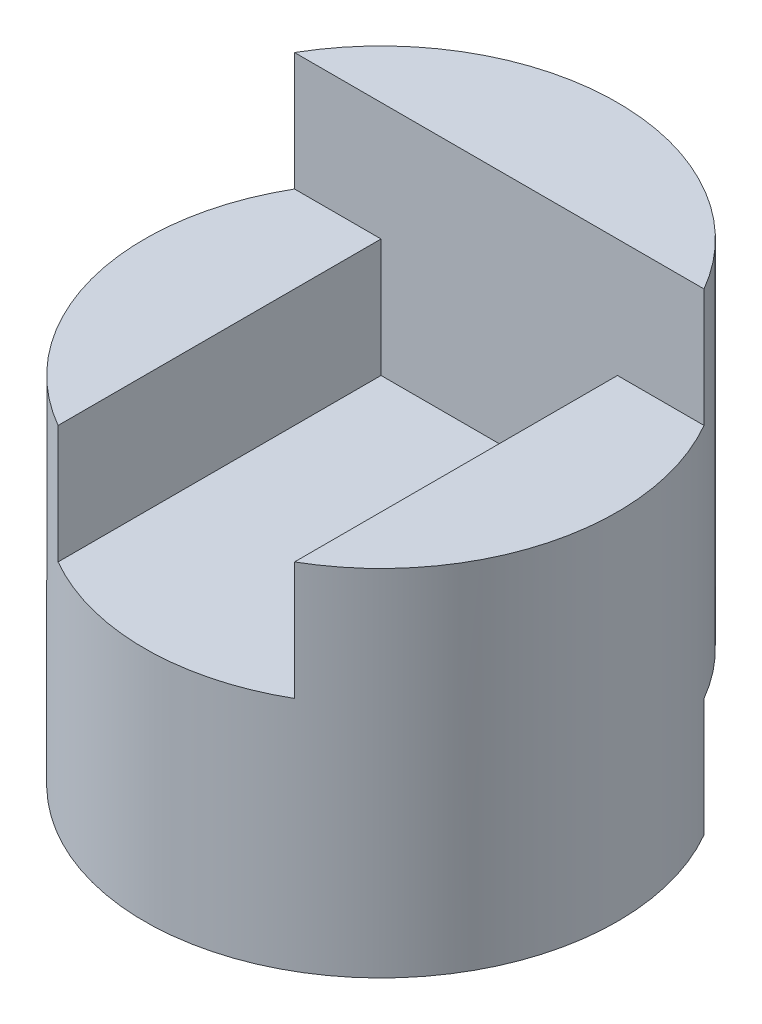
ISO-10303-21;
HEADER;
FILE_DESCRIPTION(('STEP AP214'),'2;1');
FILE_NAME('part.step','',(''),(''),'','','');
FILE_SCHEMA(('AUTOMOTIVE_DESIGN { 1 0 10303 214 1 1 1 1 }'));
ENDSEC;
DATA;
#1=APPLICATION_CONTEXT('core data for automotive mechanical design processes');
#2=APPLICATION_PROTOCOL_DEFINITION('international standard','automotive_design',2000,#1);
#3=PRODUCT_CONTEXT('',#1,'mechanical');
#4=PRODUCT('Part','Part','',(#3));
#5=PRODUCT_RELATED_PRODUCT_CATEGORY('part','',(#4));
#6=PRODUCT_DEFINITION_FORMATION('','',#4);
#7=PRODUCT_DEFINITION_CONTEXT('part definition',#1,'design');
#8=PRODUCT_DEFINITION('design','',#6,#7);
#9=PRODUCT_DEFINITION_SHAPE('','',#8);
#10=(LENGTH_UNIT() NAMED_UNIT(*) SI_UNIT(.MILLI.,.METRE.));
#11=(NAMED_UNIT(*) PLANE_ANGLE_UNIT() SI_UNIT($,.RADIAN.));
#12=(NAMED_UNIT(*) SI_UNIT($,.STERADIAN.) SOLID_ANGLE_UNIT());
#13=UNCERTAINTY_MEASURE_WITH_UNIT(LENGTH_MEASURE(1.E-05),#10,'distance_accuracy_value','');
#14=(GEOMETRIC_REPRESENTATION_CONTEXT(3) GLOBAL_UNCERTAINTY_ASSIGNED_CONTEXT((#13)) GLOBAL_UNIT_ASSIGNED_CONTEXT((#10,
#11,#12)) REPRESENTATION_CONTEXT('',''));
#15=CARTESIAN_POINT('',(0.,0.,0.));
#16=DIRECTION('',(0.,0.,1.));
#17=DIRECTION('',(1.,0.,0.));
#18=AXIS2_PLACEMENT_3D('',#15,#16,#17);
#19=CARTESIAN_POINT('',(0.,4.,0.));
#20=DIRECTION('',(0.,-1.,0.));
#21=DIRECTION('',(0.,0.,-1.));
#22=AXIS2_PLACEMENT_3D('',#19,#20,#21);
#23=CYLINDRICAL_SURFACE('',#22,2.);
#24=CARTESIAN_POINT('',(0.,1.,0.));
#25=DIRECTION('',(0.,-1.,0.));
#26=DIRECTION('',(0.,0.,1.));
#27=AXIS2_PLACEMENT_3D('',#24,#25,#26);
#28=CIRCLE('',#27,2.);
#29=CARTESIAN_POINT('',(-1.73205080756888,1.,-1.));
#30=VERTEX_POINT('',#29);
#31=CARTESIAN_POINT('',(1.73205080756888,1.,-1.));
#32=VERTEX_POINT('',#31);
#33=EDGE_CURVE('E98',#30,#32,#28,.T.);
#34=ORIENTED_EDGE('',*,*,#33,.F.);
#35=DIRECTION('',(0.,-1.,0.));
#36=VECTOR('',#35,1.);
#37=CARTESIAN_POINT('',(-1.73205080756888,1.,-1.));
#38=LINE('',#37,#36);
#39=CARTESIAN_POINT('',(-1.73205080756888,0.,-1.));
#40=VERTEX_POINT('',#39);
#41=EDGE_CURVE('E106',#30,#40,#38,.T.);
#42=ORIENTED_EDGE('',*,*,#41,.T.);
#43=CARTESIAN_POINT('',(0.,0.,0.));
#44=DIRECTION('',(0.,1.,0.));
#45=DIRECTION('',(0.,0.,1.));
#46=AXIS2_PLACEMENT_3D('',#43,#44,#45);
#47=CIRCLE('',#46,2.);
#48=CARTESIAN_POINT('',(1.73205080756888,0.,-1.));
#49=VERTEX_POINT('',#48);
#50=EDGE_CURVE('E111',#40,#49,#47,.T.);
#51=ORIENTED_EDGE('',*,*,#50,.T.);
#52=DIRECTION('',(0.,-1.,0.));
#53=VECTOR('',#52,1.);
#54=CARTESIAN_POINT('',(1.73205080756888,1.,-1.));
#55=LINE('',#54,#53);
#56=EDGE_CURVE('E47',#32,#49,#55,.T.);
#57=ORIENTED_EDGE('',*,*,#56,.F.);
#58=EDGE_LOOP('',(#34,#42,#51,#57));
#59=FACE_BOUND('',#58,.T.);
#60=DIRECTION('',(0.,-1.,0.));
#61=VECTOR('',#60,1.);
#62=CARTESIAN_POINT('',(1.73205080756888,4.,-1.));
#63=LINE('',#62,#61);
#64=CARTESIAN_POINT('',(1.73205080756888,4.,-1.));
#65=VERTEX_POINT('',#64);
#66=CARTESIAN_POINT('',(1.73205080756888,3.,-1.));
#67=VERTEX_POINT('',#66);
#68=EDGE_CURVE('E55',#65,#67,#63,.T.);
#69=ORIENTED_EDGE('',*,*,#68,.T.);
#70=CARTESIAN_POINT('',(0.,3.,0.));
#71=DIRECTION('',(0.,1.,0.));
#72=DIRECTION('',(0.,0.,1.));
#73=AXIS2_PLACEMENT_3D('',#70,#71,#72);
#74=CIRCLE('',#73,2.);
#75=CARTESIAN_POINT('',(1.,3.,1.73205080756888));
#76=VERTEX_POINT('',#75);
#77=EDGE_CURVE('E11',#76,#67,#74,.T.);
#78=ORIENTED_EDGE('',*,*,#77,.F.);
#79=DIRECTION('',(0.,-1.,0.));
#80=VECTOR('',#79,1.);
#81=CARTESIAN_POINT('',(1.,4.,1.73205080756888));
#82=LINE('',#81,#80);
#83=CARTESIAN_POINT('',(1.,2.,1.73205080756888));
#84=VERTEX_POINT('',#83);
#85=EDGE_CURVE('E40',#84,#76,#82,.F.);
#86=ORIENTED_EDGE('',*,*,#85,.F.);
#87=CARTESIAN_POINT('',(0.,2.,0.));
#88=DIRECTION('',(0.,1.,0.));
#89=DIRECTION('',(-1.,0.,0.));
#90=AXIS2_PLACEMENT_3D('',#87,#88,#89);
#91=CIRCLE('',#90,2.);
#92=CARTESIAN_POINT('',(-1.,2.,1.73205080756888));
#93=VERTEX_POINT('',#92);
#94=EDGE_CURVE('E152',#93,#84,#91,.T.);
#95=ORIENTED_EDGE('',*,*,#94,.F.);
#96=DIRECTION('',(0.,-1.,0.));
#97=VECTOR('',#96,1.);
#98=CARTESIAN_POINT('',(-1.,4.,1.73205080756888));
#99=LINE('',#98,#97);
#100=CARTESIAN_POINT('',(-1.,3.,1.73205080756888));
#101=VERTEX_POINT('',#100);
#102=EDGE_CURVE('E150',#101,#93,#99,.T.);
#103=ORIENTED_EDGE('',*,*,#102,.F.);
#104=CARTESIAN_POINT('',(0.,3.,0.));
#105=DIRECTION('',(0.,1.,0.));
#106=DIRECTION('',(-1.,0.,0.));
#107=AXIS2_PLACEMENT_3D('',#104,#105,#106);
#108=CIRCLE('',#107,2.);
#109=CARTESIAN_POINT('',(-1.73205080756888,3.,-1.));
#110=VERTEX_POINT('',#109);
#111=EDGE_CURVE('E148',#110,#101,#108,.T.);
#112=ORIENTED_EDGE('',*,*,#111,.F.);
#113=DIRECTION('',(0.,-1.,0.));
#114=VECTOR('',#113,1.);
#115=CARTESIAN_POINT('',(-1.73205080756888,4.,-1.));
#116=LINE('',#115,#114);
#117=CARTESIAN_POINT('',(-1.73205080756888,4.,-1.));
#118=VERTEX_POINT('',#117);
#119=EDGE_CURVE('E138',#110,#118,#116,.F.);
#120=ORIENTED_EDGE('',*,*,#119,.T.);
#121=CARTESIAN_POINT('',(0.,4.,0.));
#122=DIRECTION('',(0.,1.,0.));
#123=DIRECTION('',(0.,0.,1.));
#124=AXIS2_PLACEMENT_3D('',#121,#122,#123);
#125=CIRCLE('',#124,2.);
#126=EDGE_CURVE('E142',#65,#118,#125,.T.);
#127=ORIENTED_EDGE('',*,*,#126,.F.);
#128=EDGE_LOOP('',(#69,#78,#86,#95,#103,#112,#120,#127));
#129=FACE_BOUND('',#128,.T.);
#130=ADVANCED_FACE('F33',(#59,#129),#23,.T.);
#131=CARTESIAN_POINT('',(0.,4.,0.));
#132=DIRECTION('',(0.,1.,0.));
#133=DIRECTION('',(0.,0.,1.));
#134=AXIS2_PLACEMENT_3D('',#131,#132,#133);
#135=PLANE('',#134);
#136=DIRECTION('',(-1.,0.,0.));
#137=VECTOR('',#136,1.);
#138=CARTESIAN_POINT('',(0.,4.,-1.));
#139=LINE('',#138,#137);
#140=EDGE_CURVE('E145',#65,#118,#139,.T.);
#141=ORIENTED_EDGE('',*,*,#140,.F.);
#142=ORIENTED_EDGE('',*,*,#126,.T.);
#143=EDGE_LOOP('',(#141,#142));
#144=FACE_BOUND('',#143,.T.);
#145=ADVANCED_FACE('F167',(#144),#135,.T.);
#146=CARTESIAN_POINT('',(0.,0.,0.));
#147=DIRECTION('',(0.,1.,0.));
#148=DIRECTION('',(0.,0.,1.));
#149=AXIS2_PLACEMENT_3D('',#146,#147,#148);
#150=PLANE('',#149);
#151=ORIENTED_EDGE('',*,*,#50,.F.);
#152=DIRECTION('',(-1.,0.,0.));
#153=VECTOR('',#152,1.);
#154=CARTESIAN_POINT('',(1.73205080756888,0.,-1.));
#155=LINE('',#154,#153);
#156=EDGE_CURVE('E103',#49,#40,#155,.T.);
#157=ORIENTED_EDGE('',*,*,#156,.F.);
#158=EDGE_LOOP('',(#151,#157));
#159=FACE_BOUND('',#158,.T.);
#160=ADVANCED_FACE('F193',(#159),#150,.F.);
#161=CARTESIAN_POINT('',(-1.,3.,3.));
#162=DIRECTION('',(0.,1.,0.));
#163=DIRECTION('',(-1.,0.,0.));
#164=AXIS2_PLACEMENT_3D('',#161,#162,#163);
#165=PLANE('',#164);
#166=ORIENTED_EDGE('',*,*,#111,.T.);
#167=DIRECTION('',(0.,0.,-1.));
#168=VECTOR('',#167,1.);
#169=CARTESIAN_POINT('',(-1.,3.,3.));
#170=LINE('',#169,#168);
#171=CARTESIAN_POINT('',(-1.,3.,-1.));
#172=VERTEX_POINT('',#171);
#173=EDGE_CURVE('E136',#101,#172,#170,.T.);
#174=ORIENTED_EDGE('',*,*,#173,.T.);
#175=DIRECTION('',(1.,0.,0.));
#176=VECTOR('',#175,1.);
#177=CARTESIAN_POINT('',(-1.,3.,-1.));
#178=LINE('',#177,#176);
#179=EDGE_CURVE('E113',#110,#172,#178,.T.);
#180=ORIENTED_EDGE('',*,*,#179,.F.);
#181=EDGE_LOOP('',(#166,#174,#180));
#182=FACE_BOUND('',#181,.T.);
#183=ADVANCED_FACE('F172',(#182),#165,.T.);
#184=CARTESIAN_POINT('',(-1.,2.,3.));
#185=DIRECTION('',(1.,0.,0.));
#186=DIRECTION('',(0.,0.,-1.));
#187=AXIS2_PLACEMENT_3D('',#184,#185,#186);
#188=PLANE('',#187);
#189=ORIENTED_EDGE('',*,*,#102,.T.);
#190=DIRECTION('',(0.,0.,-1.));
#191=VECTOR('',#190,1.);
#192=CARTESIAN_POINT('',(-1.,2.,3.));
#193=LINE('',#192,#191);
#194=CARTESIAN_POINT('',(-1.,2.,-1.));
#195=VERTEX_POINT('',#194);
#196=EDGE_CURVE('E134',#93,#195,#193,.T.);
#197=ORIENTED_EDGE('',*,*,#196,.T.);
#198=DIRECTION('',(0.,-1.,0.));
#199=VECTOR('',#198,1.);
#200=CARTESIAN_POINT('',(-1.,2.,-1.));
#201=LINE('',#200,#199);
#202=EDGE_CURVE('E119',#172,#195,#201,.T.);
#203=ORIENTED_EDGE('',*,*,#202,.F.);
#204=ORIENTED_EDGE('',*,*,#173,.F.);
#205=EDGE_LOOP('',(#189,#197,#203,#204));
#206=FACE_BOUND('',#205,.T.);
#207=ADVANCED_FACE('F177',(#206),#188,.T.);
#208=CARTESIAN_POINT('',(1.,2.,3.));
#209=DIRECTION('',(0.,1.,0.));
#210=DIRECTION('',(-1.,0.,0.));
#211=AXIS2_PLACEMENT_3D('',#208,#209,#210);
#212=PLANE('',#211);
#213=ORIENTED_EDGE('',*,*,#94,.T.);
#214=DIRECTION('',(0.,0.,-1.));
#215=VECTOR('',#214,1.);
#216=CARTESIAN_POINT('',(1.,2.,3.));
#217=LINE('',#216,#215);
#218=CARTESIAN_POINT('',(1.,2.,-1.));
#219=VERTEX_POINT('',#218);
#220=EDGE_CURVE('E132',#84,#219,#217,.T.);
#221=ORIENTED_EDGE('',*,*,#220,.T.);
#222=DIRECTION('',(1.,0.,0.));
#223=VECTOR('',#222,1.);
#224=CARTESIAN_POINT('',(1.,2.,-1.));
#225=LINE('',#224,#223);
#226=EDGE_CURVE('E122',#195,#219,#225,.T.);
#227=ORIENTED_EDGE('',*,*,#226,.F.);
#228=ORIENTED_EDGE('',*,*,#196,.F.);
#229=EDGE_LOOP('',(#213,#221,#227,#228));
#230=FACE_BOUND('',#229,.T.);
#231=ADVANCED_FACE('F180',(#230),#212,.T.);
#232=CARTESIAN_POINT('',(1.,3.,3.));
#233=DIRECTION('',(-1.,0.,0.));
#234=DIRECTION('',(0.,-1.,0.));
#235=AXIS2_PLACEMENT_3D('',#232,#233,#234);
#236=PLANE('',#235);
#237=ORIENTED_EDGE('',*,*,#85,.T.);
#238=DIRECTION('',(0.,0.,-1.));
#239=VECTOR('',#238,1.);
#240=CARTESIAN_POINT('',(1.,3.,3.));
#241=LINE('',#240,#239);
#242=CARTESIAN_POINT('',(1.,3.,-1.));
#243=VERTEX_POINT('',#242);
#244=EDGE_CURVE('E130',#76,#243,#241,.T.);
#245=ORIENTED_EDGE('',*,*,#244,.T.);
#246=DIRECTION('',(0.,1.,0.));
#247=VECTOR('',#246,1.);
#248=CARTESIAN_POINT('',(1.,3.,-1.));
#249=LINE('',#248,#247);
#250=EDGE_CURVE('E125',#219,#243,#249,.T.);
#251=ORIENTED_EDGE('',*,*,#250,.F.);
#252=ORIENTED_EDGE('',*,*,#220,.F.);
#253=EDGE_LOOP('',(#237,#245,#251,#252));
#254=FACE_BOUND('',#253,.T.);
#255=ADVANCED_FACE('F157',(#254),#236,.T.);
#256=CARTESIAN_POINT('',(2.,3.,3.));
#257=DIRECTION('',(0.,1.,0.));
#258=DIRECTION('',(0.,0.,1.));
#259=AXIS2_PLACEMENT_3D('',#256,#257,#258);
#260=PLANE('',#259);
#261=ORIENTED_EDGE('',*,*,#77,.T.);
#262=DIRECTION('',(1.,0.,0.));
#263=VECTOR('',#262,1.);
#264=CARTESIAN_POINT('',(2.,3.,-1.));
#265=LINE('',#264,#263);
#266=EDGE_CURVE('E128',#243,#67,#265,.T.);
#267=ORIENTED_EDGE('',*,*,#266,.F.);
#268=ORIENTED_EDGE('',*,*,#244,.F.);
#269=EDGE_LOOP('',(#261,#267,#268));
#270=FACE_BOUND('',#269,.T.);
#271=ADVANCED_FACE('F163',(#270),#260,.T.);
#272=CARTESIAN_POINT('',(0.,0.,-1.));
#273=DIRECTION('',(0.,0.,-1.));
#274=DIRECTION('',(-1.,0.,0.));
#275=AXIS2_PLACEMENT_3D('',#272,#273,#274);
#276=PLANE('',#275);
#277=ORIENTED_EDGE('',*,*,#140,.T.);
#278=ORIENTED_EDGE('',*,*,#119,.F.);
#279=ORIENTED_EDGE('',*,*,#179,.T.);
#280=ORIENTED_EDGE('',*,*,#202,.T.);
#281=ORIENTED_EDGE('',*,*,#226,.T.);
#282=ORIENTED_EDGE('',*,*,#250,.T.);
#283=ORIENTED_EDGE('',*,*,#266,.T.);
#284=ORIENTED_EDGE('',*,*,#68,.F.);
#285=EDGE_LOOP('',(#277,#278,#279,#280,#281,#282,#283,#284));
#286=FACE_BOUND('',#285,.T.);
#287=ADVANCED_FACE('F168',(#286),#276,.F.);
#288=CARTESIAN_POINT('',(1.73205080756888,1.,-1.));
#289=DIRECTION('',(0.,0.,1.));
#290=DIRECTION('',(1.,0.,0.));
#291=AXIS2_PLACEMENT_3D('',#288,#289,#290);
#292=PLANE('',#291);
#293=ORIENTED_EDGE('',*,*,#156,.T.);
#294=ORIENTED_EDGE('',*,*,#41,.F.);
#295=DIRECTION('',(-1.,0.,0.));
#296=VECTOR('',#295,1.);
#297=CARTESIAN_POINT('',(1.73205080756888,1.,-1.));
#298=LINE('',#297,#296);
#299=EDGE_CURVE('E100',#32,#30,#298,.T.);
#300=ORIENTED_EDGE('',*,*,#299,.F.);
#301=ORIENTED_EDGE('',*,*,#56,.T.);
#302=EDGE_LOOP('',(#293,#294,#300,#301));
#303=FACE_BOUND('',#302,.T.);
#304=ADVANCED_FACE('F105',(#303),#292,.F.);
#305=CARTESIAN_POINT('',(0.,1.,0.));
#306=DIRECTION('',(0.,1.,0.));
#307=DIRECTION('',(0.,0.,1.));
#308=AXIS2_PLACEMENT_3D('',#305,#306,#307);
#309=PLANE('',#308);
#310=ORIENTED_EDGE('',*,*,#33,.T.);
#311=ORIENTED_EDGE('',*,*,#299,.T.);
#312=EDGE_LOOP('',(#310,#311));
#313=FACE_BOUND('',#312,.T.);
#314=ADVANCED_FACE('F99',(#313),#309,.F.);
#315=CLOSED_SHELL('',(#130,#145,#160,#183,#207,#231,#255,#271,#287,#304,#314));
#316=MANIFOLD_SOLID_BREP('B2',#315);
#317=ADVANCED_BREP_SHAPE_REPRESENTATION('',(#18,#316),#14);
#318=SHAPE_DEFINITION_REPRESENTATION(#9,#317);
ENDSEC;
END-ISO-10303-21;
